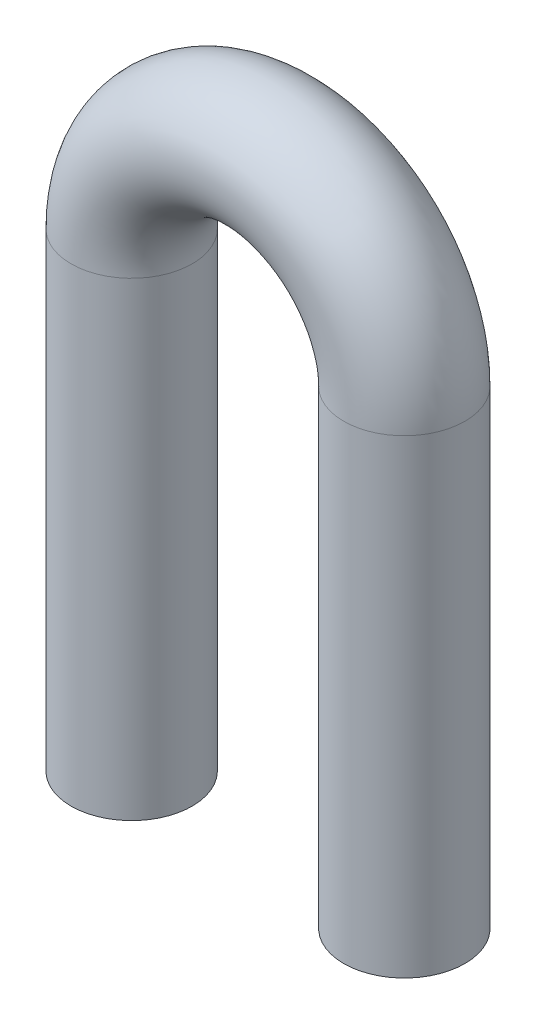
ISO-10303-21;
HEADER;
FILE_DESCRIPTION(('STEP AP214'),'2;1');
FILE_NAME('part.step','',(''),(''),'','','');
FILE_SCHEMA(('AUTOMOTIVE_DESIGN { 1 0 10303 214 1 1 1 1 }'));
ENDSEC;
DATA;
#1=APPLICATION_CONTEXT('core data for automotive mechanical design processes');
#2=APPLICATION_PROTOCOL_DEFINITION('international standard','automotive_design',2000,#1);
#3=PRODUCT_CONTEXT('',#1,'mechanical');
#4=PRODUCT('Part','Part','',(#3));
#5=PRODUCT_RELATED_PRODUCT_CATEGORY('part','',(#4));
#6=PRODUCT_DEFINITION_FORMATION('','',#4);
#7=PRODUCT_DEFINITION_CONTEXT('part definition',#1,'design');
#8=PRODUCT_DEFINITION('design','',#6,#7);
#9=PRODUCT_DEFINITION_SHAPE('','',#8);
#10=(LENGTH_UNIT() NAMED_UNIT(*) SI_UNIT(.MILLI.,.METRE.));
#11=(NAMED_UNIT(*) PLANE_ANGLE_UNIT() SI_UNIT($,.RADIAN.));
#12=(NAMED_UNIT(*) SI_UNIT($,.STERADIAN.) SOLID_ANGLE_UNIT());
#13=UNCERTAINTY_MEASURE_WITH_UNIT(LENGTH_MEASURE(1.E-05),#10,'distance_accuracy_value','');
#14=(GEOMETRIC_REPRESENTATION_CONTEXT(3) GLOBAL_UNCERTAINTY_ASSIGNED_CONTEXT((#13)) GLOBAL_UNIT_ASSIGNED_CONTEXT((#10,
#11,#12)) REPRESENTATION_CONTEXT('',''));
#15=CARTESIAN_POINT('',(0.,0.,0.));
#16=DIRECTION('',(0.,0.,1.));
#17=DIRECTION('',(1.,0.,0.));
#18=AXIS2_PLACEMENT_3D('',#15,#16,#17);
#19=CARTESIAN_POINT('',(0.,0.,0.));
#20=DIRECTION('',(0.,1.,0.));
#21=DIRECTION('',(0.,0.,1.));
#22=AXIS2_PLACEMENT_3D('',#19,#20,#21);
#23=PLANE('',#22);
#24=CARTESIAN_POINT('',(0.,0.,0.));
#25=DIRECTION('',(0.,1.,0.));
#26=DIRECTION('',(0.,0.,1.));
#27=AXIS2_PLACEMENT_3D('',#24,#25,#26);
#28=CIRCLE('',#27,2.);
#29=CARTESIAN_POINT('',(0.,0.,2.));
#30=VERTEX_POINT('',#29);
#31=EDGE_CURVE('E48',#30,#30,#28,.T.);
#32=ORIENTED_EDGE('',*,*,#31,.F.);
#33=EDGE_LOOP('',(#32));
#34=FACE_BOUND('',#33,.T.);
#35=ADVANCED_FACE('F36',(#34),#23,.F.);
#36=CARTESIAN_POINT('',(8.99999999999994,0.,0.));
#37=DIRECTION('',(0.,-1.,0.));
#38=DIRECTION('',(0.,0.,1.));
#39=AXIS2_PLACEMENT_3D('',#36,#37,#38);
#40=PLANE('',#39);
#41=CARTESIAN_POINT('',(8.99999999999994,0.,0.));
#42=DIRECTION('',(0.,-1.,0.));
#43=DIRECTION('',(0.,0.,1.));
#44=AXIS2_PLACEMENT_3D('',#41,#42,#43);
#45=CIRCLE('',#44,2.);
#46=CARTESIAN_POINT('',(8.99999999999994,0.,2.));
#47=VERTEX_POINT('',#46);
#48=EDGE_CURVE('E11',#47,#47,#45,.T.);
#49=ORIENTED_EDGE('',*,*,#48,.T.);
#50=EDGE_LOOP('',(#49));
#51=FACE_BOUND('',#50,.T.);
#52=ADVANCED_FACE('F51',(#51),#40,.T.);
#53=CARTESIAN_POINT('',(0.,0.,0.));
#54=DIRECTION('',(0.,1.,0.));
#55=DIRECTION('',(0.,0.,1.));
#56=AXIS2_PLACEMENT_3D('',#53,#54,#55);
#57=CYLINDRICAL_SURFACE('',#56,2.);
#58=CARTESIAN_POINT('',(0.,15.5,0.));
#59=DIRECTION('',(0.,1.,0.));
#60=DIRECTION('',(0.,0.,1.));
#61=AXIS2_PLACEMENT_3D('',#58,#59,#60);
#62=CIRCLE('',#61,2.);
#63=CARTESIAN_POINT('',(-2.,15.5,0.));
#64=VERTEX_POINT('',#63);
#65=EDGE_CURVE('E61',#64,#64,#62,.T.);
#66=ORIENTED_EDGE('',*,*,#65,.F.);
#67=EDGE_LOOP('',(#66));
#68=FACE_BOUND('',#67,.T.);
#69=ORIENTED_EDGE('',*,*,#31,.T.);
#70=EDGE_LOOP('',(#69));
#71=FACE_BOUND('',#70,.T.);
#72=ADVANCED_FACE('F66',(#68,#71),#57,.T.);
#73=CARTESIAN_POINT('',(4.5,15.5,0.));
#74=DIRECTION('',(0.,0.,-1.));
#75=DIRECTION('',(-1.,0.,0.));
#76=AXIS2_PLACEMENT_3D('',#73,#74,#75);
#77=TOROIDAL_SURFACE('',#76,4.5,2.);
#78=CARTESIAN_POINT('',(9.,15.5,0.));
#79=DIRECTION('',(0.,-1.,0.));
#80=DIRECTION('',(0.,0.,1.));
#81=AXIS2_PLACEMENT_3D('',#78,#79,#80);
#82=CIRCLE('',#81,2.);
#83=CARTESIAN_POINT('',(11.,15.5,0.));
#84=VERTEX_POINT('',#83);
#85=EDGE_CURVE('E43',#84,#84,#82,.T.);
#86=CARTESIAN_POINT('',(4.5,15.5,0.));
#87=DIRECTION('',(0.,0.,-1.));
#88=DIRECTION('',(-1.,0.,0.));
#89=AXIS2_PLACEMENT_3D('',#86,#87,#88);
#90=CIRCLE('',#89,6.5);
#91=EDGE_CURVE('',#64,#84,#90,.T.);
#92=ORIENTED_EDGE('',*,*,#65,.T.);
#93=ORIENTED_EDGE('',*,*,#85,.F.);
#94=ORIENTED_EDGE('',*,*,#91,.T.);
#95=ORIENTED_EDGE('',*,*,#91,.F.);
#96=EDGE_LOOP('',(#92,#94,#93,#95));
#97=FACE_BOUND('',#96,.T.);
#98=ADVANCED_FACE('F56',(#97),#77,.T.);
#99=CARTESIAN_POINT('',(9.,15.5,0.));
#100=DIRECTION('',(0.,-1.,0.));
#101=DIRECTION('',(1.,0.,0.));
#102=AXIS2_PLACEMENT_3D('',#99,#100,#101);
#103=CYLINDRICAL_SURFACE('',#102,2.);
#104=ORIENTED_EDGE('',*,*,#48,.F.);
#105=EDGE_LOOP('',(#104));
#106=FACE_BOUND('',#105,.T.);
#107=ORIENTED_EDGE('',*,*,#85,.T.);
#108=EDGE_LOOP('',(#107));
#109=FACE_BOUND('',#108,.T.);
#110=ADVANCED_FACE('F53',(#106,#109),#103,.T.);
#111=CLOSED_SHELL('',(#35,#52,#72,#98,#110));
#112=MANIFOLD_SOLID_BREP('B2',#111);
#113=ADVANCED_BREP_SHAPE_REPRESENTATION('',(#18,#112),#14);
#114=SHAPE_DEFINITION_REPRESENTATION(#9,#113);
ENDSEC;
END-ISO-10303-21;
